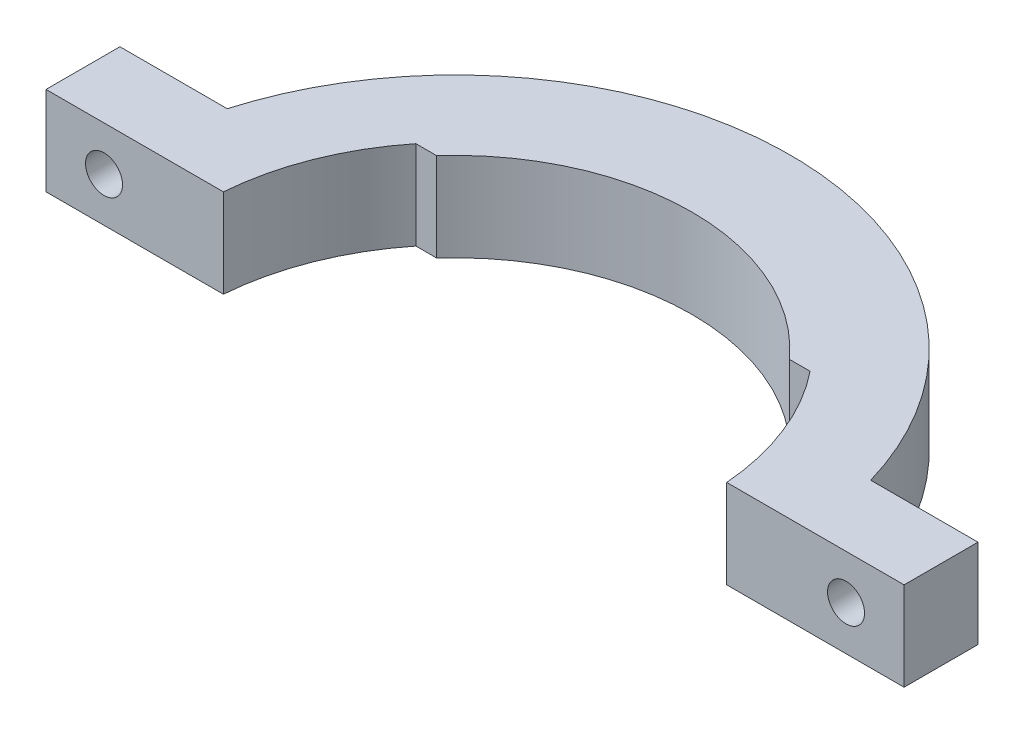
ISO-10303-21;
HEADER;
FILE_DESCRIPTION(('STEP AP214'),'2;1');
FILE_NAME('part.step','',(''),(''),'','','');
FILE_SCHEMA(('AUTOMOTIVE_DESIGN { 1 0 10303 214 1 1 1 1 }'));
ENDSEC;
DATA;
#1=APPLICATION_CONTEXT('core data for automotive mechanical design processes');
#2=APPLICATION_PROTOCOL_DEFINITION('international standard','automotive_design',2000,#1);
#3=PRODUCT_CONTEXT('',#1,'mechanical');
#4=PRODUCT('Part','Part','',(#3));
#5=PRODUCT_RELATED_PRODUCT_CATEGORY('part','',(#4));
#6=PRODUCT_DEFINITION_FORMATION('','',#4);
#7=PRODUCT_DEFINITION_CONTEXT('part definition',#1,'design');
#8=PRODUCT_DEFINITION('design','',#6,#7);
#9=PRODUCT_DEFINITION_SHAPE('','',#8);
#10=(LENGTH_UNIT() NAMED_UNIT(*) SI_UNIT(.MILLI.,.METRE.));
#11=(NAMED_UNIT(*) PLANE_ANGLE_UNIT() SI_UNIT($,.RADIAN.));
#12=(NAMED_UNIT(*) SI_UNIT($,.STERADIAN.) SOLID_ANGLE_UNIT());
#13=UNCERTAINTY_MEASURE_WITH_UNIT(LENGTH_MEASURE(1.E-05),#10,'distance_accuracy_value','');
#14=(GEOMETRIC_REPRESENTATION_CONTEXT(3) GLOBAL_UNCERTAINTY_ASSIGNED_CONTEXT((#13)) GLOBAL_UNIT_ASSIGNED_CONTEXT((#10,
#11,#12)) REPRESENTATION_CONTEXT('',''));
#15=CARTESIAN_POINT('',(0.,0.,0.));
#16=DIRECTION('',(0.,0.,1.));
#17=DIRECTION('',(1.,0.,0.));
#18=AXIS2_PLACEMENT_3D('',#15,#16,#17);
#19=CARTESIAN_POINT('',(37.645,4.5,-2.));
#20=DIRECTION('',(0.,0.,-1.));
#21=DIRECTION('',(-1.,0.,0.));
#22=AXIS2_PLACEMENT_3D('',#19,#20,#21);
#23=CYLINDRICAL_SURFACE('',#22,1.875);
#24=CARTESIAN_POINT('',(37.645,4.5,-2.));
#25=DIRECTION('',(0.,0.,-1.));
#26=DIRECTION('',(-1.,0.,0.));
#27=AXIS2_PLACEMENT_3D('',#24,#25,#26);
#28=CIRCLE('',#27,1.875);
#29=CARTESIAN_POINT('',(35.77,4.5,-2.));
#30=VERTEX_POINT('',#29);
#31=EDGE_CURVE('E427',#30,#30,#28,.T.);
#32=ORIENTED_EDGE('',*,*,#31,.F.);
#33=EDGE_LOOP('',(#32));
#34=FACE_BOUND('',#33,.T.);
#35=CARTESIAN_POINT('',(37.645,4.5,-6.69999999999999));
#36=DIRECTION('',(0.,0.,-1.));
#37=DIRECTION('',(-1.,0.,0.));
#38=AXIS2_PLACEMENT_3D('',#35,#36,#37);
#39=CIRCLE('',#38,1.875);
#40=CARTESIAN_POINT('',(35.77,4.5,-6.69999999999999));
#41=VERTEX_POINT('',#40);
#42=EDGE_CURVE('E441',#41,#41,#39,.T.);
#43=ORIENTED_EDGE('',*,*,#42,.T.);
#44=EDGE_LOOP('',(#43));
#45=FACE_BOUND('',#44,.T.);
#46=ADVANCED_FACE('F33',(#34,#45),#23,.F.);
#47=CARTESIAN_POINT('',(0.,9.,0.));
#48=DIRECTION('',(0.,-1.,0.));
#49=DIRECTION('',(0.,0.,-1.));
#50=AXIS2_PLACEMENT_3D('',#47,#48,#49);
#51=CYLINDRICAL_SURFACE('',#50,25.6124969497314);
#52=CARTESIAN_POINT('',(0.,0.,0.));
#53=DIRECTION('',(0.,-1.,0.));
#54=DIRECTION('',(0.,0.,-1.));
#55=AXIS2_PLACEMENT_3D('',#52,#53,#54);
#56=CIRCLE('',#55,25.6124969497314);
#57=CARTESIAN_POINT('',(-25.5342906696074,0.,-2.));
#58=VERTEX_POINT('',#57);
#59=CARTESIAN_POINT('',(-20.,0.,-16.));
#60=VERTEX_POINT('',#59);
#61=EDGE_CURVE('E154',#58,#60,#56,.T.);
#62=ORIENTED_EDGE('',*,*,#61,.T.);
#63=DIRECTION('',(0.,-1.,0.));
#64=VECTOR('',#63,1.);
#65=CARTESIAN_POINT('',(-20.,9.,-16.));
#66=LINE('',#65,#64);
#67=CARTESIAN_POINT('',(-20.,9.,-16.));
#68=VERTEX_POINT('',#67);
#69=EDGE_CURVE('E11',#68,#60,#66,.T.);
#70=ORIENTED_EDGE('',*,*,#69,.F.);
#71=CARTESIAN_POINT('',(0.,9.,0.));
#72=DIRECTION('',(0.,-1.,0.));
#73=DIRECTION('',(0.,0.,-1.));
#74=AXIS2_PLACEMENT_3D('',#71,#72,#73);
#75=CIRCLE('',#74,25.6124969497314);
#76=CARTESIAN_POINT('',(-25.5342906696074,9.,-2.));
#77=VERTEX_POINT('',#76);
#78=EDGE_CURVE('E177',#77,#68,#75,.T.);
#79=ORIENTED_EDGE('',*,*,#78,.F.);
#80=DIRECTION('',(0.,-1.,0.));
#81=VECTOR('',#80,1.);
#82=CARTESIAN_POINT('',(-25.5342906696074,9.,-2.));
#83=LINE('',#82,#81);
#84=EDGE_CURVE('E150',#77,#58,#83,.T.);
#85=ORIENTED_EDGE('',*,*,#84,.T.);
#86=EDGE_LOOP('',(#62,#70,#79,#85));
#87=FACE_BOUND('',#86,.T.);
#88=ADVANCED_FACE('F35',(#87),#51,.F.);
#89=CARTESIAN_POINT('',(-17.8885438199983,9.,-16.));
#90=DIRECTION('',(0.,0.,-1.));
#91=DIRECTION('',(-1.,0.,0.));
#92=AXIS2_PLACEMENT_3D('',#89,#90,#91);
#93=PLANE('',#92);
#94=DIRECTION('',(1.,0.,0.));
#95=VECTOR('',#94,1.);
#96=CARTESIAN_POINT('',(-17.8885438199983,0.,-16.));
#97=LINE('',#96,#95);
#98=CARTESIAN_POINT('',(-17.8885438199983,0.,-16.));
#99=VERTEX_POINT('',#98);
#100=EDGE_CURVE('E157',#60,#99,#97,.T.);
#101=ORIENTED_EDGE('',*,*,#100,.T.);
#102=DIRECTION('',(0.,-1.,0.));
#103=VECTOR('',#102,1.);
#104=CARTESIAN_POINT('',(-17.8885438199983,9.,-16.));
#105=LINE('',#104,#103);
#106=CARTESIAN_POINT('',(-17.8885438199983,9.,-16.));
#107=VERTEX_POINT('',#106);
#108=EDGE_CURVE('E42',#107,#99,#105,.T.);
#109=ORIENTED_EDGE('',*,*,#108,.F.);
#110=DIRECTION('',(1.,0.,0.));
#111=VECTOR('',#110,1.);
#112=CARTESIAN_POINT('',(-17.8885438199983,9.,-16.));
#113=LINE('',#112,#111);
#114=EDGE_CURVE('E105',#68,#107,#113,.T.);
#115=ORIENTED_EDGE('',*,*,#114,.F.);
#116=ORIENTED_EDGE('',*,*,#69,.T.);
#117=EDGE_LOOP('',(#101,#109,#115,#116));
#118=FACE_BOUND('',#117,.T.);
#119=ADVANCED_FACE('F262',(#118),#93,.F.);
#120=CARTESIAN_POINT('',(0.,9.,0.));
#121=DIRECTION('',(0.,-1.,0.));
#122=DIRECTION('',(0.,0.,-1.));
#123=AXIS2_PLACEMENT_3D('',#120,#121,#122);
#124=CYLINDRICAL_SURFACE('',#123,24.);
#125=CARTESIAN_POINT('',(0.,0.,0.));
#126=DIRECTION('',(0.,-1.,0.));
#127=DIRECTION('',(0.,0.,1.));
#128=AXIS2_PLACEMENT_3D('',#125,#126,#127);
#129=CIRCLE('',#128,24.);
#130=CARTESIAN_POINT('',(17.8885438199983,0.,-16.));
#131=VERTEX_POINT('',#130);
#132=EDGE_CURVE('E160',#99,#131,#129,.T.);
#133=ORIENTED_EDGE('',*,*,#132,.T.);
#134=DIRECTION('',(0.,-1.,0.));
#135=VECTOR('',#134,1.);
#136=CARTESIAN_POINT('',(17.8885438199983,9.,-16.));
#137=LINE('',#136,#135);
#138=CARTESIAN_POINT('',(17.8885438199983,9.,-16.));
#139=VERTEX_POINT('',#138);
#140=EDGE_CURVE('E196',#139,#131,#137,.T.);
#141=ORIENTED_EDGE('',*,*,#140,.F.);
#142=CARTESIAN_POINT('',(0.,9.,0.));
#143=DIRECTION('',(0.,-1.,0.));
#144=DIRECTION('',(0.,0.,1.));
#145=AXIS2_PLACEMENT_3D('',#142,#143,#144);
#146=CIRCLE('',#145,24.);
#147=EDGE_CURVE('E204',#107,#139,#146,.T.);
#148=ORIENTED_EDGE('',*,*,#147,.F.);
#149=ORIENTED_EDGE('',*,*,#108,.T.);
#150=EDGE_LOOP('',(#133,#141,#148,#149));
#151=FACE_BOUND('',#150,.T.);
#152=ADVANCED_FACE('F202',(#151),#124,.F.);
#153=CARTESIAN_POINT('',(17.8885438199983,9.,-16.));
#154=DIRECTION('',(0.,0.,-1.));
#155=DIRECTION('',(-1.,0.,0.));
#156=AXIS2_PLACEMENT_3D('',#153,#154,#155);
#157=PLANE('',#156);
#158=DIRECTION('',(1.,0.,0.));
#159=VECTOR('',#158,1.);
#160=CARTESIAN_POINT('',(17.8885438199983,0.,-16.));
#161=LINE('',#160,#159);
#162=CARTESIAN_POINT('',(20.,0.,-16.));
#163=VERTEX_POINT('',#162);
#164=EDGE_CURVE('E162',#131,#163,#161,.T.);
#165=ORIENTED_EDGE('',*,*,#164,.T.);
#166=DIRECTION('',(0.,-1.,0.));
#167=VECTOR('',#166,1.);
#168=CARTESIAN_POINT('',(20.,9.,-16.));
#169=LINE('',#168,#167);
#170=CARTESIAN_POINT('',(20.,9.,-16.));
#171=VERTEX_POINT('',#170);
#172=EDGE_CURVE('E193',#171,#163,#169,.T.);
#173=ORIENTED_EDGE('',*,*,#172,.F.);
#174=DIRECTION('',(1.,0.,0.));
#175=VECTOR('',#174,1.);
#176=CARTESIAN_POINT('',(17.8885438199983,9.,-16.));
#177=LINE('',#176,#175);
#178=EDGE_CURVE('E222',#139,#171,#177,.T.);
#179=ORIENTED_EDGE('',*,*,#178,.F.);
#180=ORIENTED_EDGE('',*,*,#140,.T.);
#181=EDGE_LOOP('',(#165,#173,#179,#180));
#182=FACE_BOUND('',#181,.T.);
#183=ADVANCED_FACE('F213',(#182),#157,.F.);
#184=CARTESIAN_POINT('',(0.,9.,0.));
#185=DIRECTION('',(0.,-1.,0.));
#186=DIRECTION('',(0.,0.,-1.));
#187=AXIS2_PLACEMENT_3D('',#184,#185,#186);
#188=CYLINDRICAL_SURFACE('',#187,25.6124969497314);
#189=CARTESIAN_POINT('',(0.,0.,0.));
#190=DIRECTION('',(0.,-1.,0.));
#191=DIRECTION('',(0.,0.,1.));
#192=AXIS2_PLACEMENT_3D('',#189,#190,#191);
#193=CIRCLE('',#192,25.6124969497314);
#194=CARTESIAN_POINT('',(25.5342906696074,0.,-2.));
#195=VERTEX_POINT('',#194);
#196=EDGE_CURVE('E164',#163,#195,#193,.T.);
#197=ORIENTED_EDGE('',*,*,#196,.T.);
#198=DIRECTION('',(0.,-1.,0.));
#199=VECTOR('',#198,1.);
#200=CARTESIAN_POINT('',(25.5342906696074,9.,-2.));
#201=LINE('',#200,#199);
#202=CARTESIAN_POINT('',(25.5342906696074,9.,-2.));
#203=VERTEX_POINT('',#202);
#204=EDGE_CURVE('E190',#203,#195,#201,.T.);
#205=ORIENTED_EDGE('',*,*,#204,.F.);
#206=CARTESIAN_POINT('',(0.,9.,0.));
#207=DIRECTION('',(0.,-1.,0.));
#208=DIRECTION('',(0.,0.,1.));
#209=AXIS2_PLACEMENT_3D('',#206,#207,#208);
#210=CIRCLE('',#209,25.6124969497314);
#211=EDGE_CURVE('E219',#171,#203,#210,.T.);
#212=ORIENTED_EDGE('',*,*,#211,.F.);
#213=ORIENTED_EDGE('',*,*,#172,.T.);
#214=EDGE_LOOP('',(#197,#205,#212,#213));
#215=FACE_BOUND('',#214,.T.);
#216=ADVANCED_FACE('F217',(#215),#188,.F.);
#217=CARTESIAN_POINT('',(25.5342906696074,9.,-2.));
#218=DIRECTION('',(0.,0.,-1.));
#219=DIRECTION('',(-1.,0.,0.));
#220=AXIS2_PLACEMENT_3D('',#217,#218,#219);
#221=PLANE('',#220);
#222=ORIENTED_EDGE('',*,*,#31,.T.);
#223=EDGE_LOOP('',(#222));
#224=FACE_BOUND('',#223,.T.);
#225=DIRECTION('',(1.,0.,0.));
#226=VECTOR('',#225,1.);
#227=CARTESIAN_POINT('',(25.5342906696074,0.,-2.));
#228=LINE('',#227,#226);
#229=CARTESIAN_POINT('',(43.5342906696074,0.,-2.));
#230=VERTEX_POINT('',#229);
#231=EDGE_CURVE('E166',#195,#230,#228,.T.);
#232=ORIENTED_EDGE('',*,*,#231,.T.);
#233=DIRECTION('',(0.,-1.,0.));
#234=VECTOR('',#233,1.);
#235=CARTESIAN_POINT('',(43.5342906696074,9.,-2.));
#236=LINE('',#235,#234);
#237=CARTESIAN_POINT('',(43.5342906696074,9.,-2.));
#238=VERTEX_POINT('',#237);
#239=EDGE_CURVE('E187',#238,#230,#236,.T.);
#240=ORIENTED_EDGE('',*,*,#239,.F.);
#241=DIRECTION('',(1.,0.,0.));
#242=VECTOR('',#241,1.);
#243=CARTESIAN_POINT('',(25.5342906696074,9.,-2.));
#244=LINE('',#243,#242);
#245=EDGE_CURVE('E221',#203,#238,#244,.T.);
#246=ORIENTED_EDGE('',*,*,#245,.F.);
#247=ORIENTED_EDGE('',*,*,#204,.T.);
#248=EDGE_LOOP('',(#232,#240,#246,#247));
#249=FACE_BOUND('',#248,.T.);
#250=ADVANCED_FACE('F372',(#224,#249),#221,.F.);
#251=CARTESIAN_POINT('',(43.5342906696074,9.,-2.));
#252=DIRECTION('',(-1.,0.,0.));
#253=DIRECTION('',(0.,0.,1.));
#254=AXIS2_PLACEMENT_3D('',#251,#252,#253);
#255=PLANE('',#254);
#256=DIRECTION('',(0.,0.,-1.));
#257=VECTOR('',#256,1.);
#258=CARTESIAN_POINT('',(43.5342906696074,0.,-2.));
#259=LINE('',#258,#257);
#260=CARTESIAN_POINT('',(43.5342906696074,0.,-9.5));
#261=VERTEX_POINT('',#260);
#262=EDGE_CURVE('E168',#230,#261,#259,.T.);
#263=ORIENTED_EDGE('',*,*,#262,.T.);
#264=DIRECTION('',(0.,-1.,0.));
#265=VECTOR('',#264,1.);
#266=CARTESIAN_POINT('',(43.5342906696074,9.,-9.5));
#267=LINE('',#266,#265);
#268=CARTESIAN_POINT('',(43.5342906696074,9.,-9.5));
#269=VERTEX_POINT('',#268);
#270=EDGE_CURVE('E184',#269,#261,#267,.T.);
#271=ORIENTED_EDGE('',*,*,#270,.F.);
#272=DIRECTION('',(0.,0.,-1.));
#273=VECTOR('',#272,1.);
#274=CARTESIAN_POINT('',(43.5342906696074,9.,-2.));
#275=LINE('',#274,#273);
#276=EDGE_CURVE('E224',#238,#269,#275,.T.);
#277=ORIENTED_EDGE('',*,*,#276,.F.);
#278=ORIENTED_EDGE('',*,*,#239,.T.);
#279=EDGE_LOOP('',(#263,#271,#277,#278));
#280=FACE_BOUND('',#279,.T.);
#281=ADVANCED_FACE('F364',(#280),#255,.F.);
#282=CARTESIAN_POINT('',(43.5342906696074,9.,-9.5));
#283=DIRECTION('',(0.,0.,1.));
#284=DIRECTION('',(1.,0.,0.));
#285=AXIS2_PLACEMENT_3D('',#282,#283,#284);
#286=PLANE('',#285);
#287=CARTESIAN_POINT('',(37.645,4.5,-9.49999999999999));
#288=DIRECTION('',(0.,0.,-1.));
#289=DIRECTION('',(-1.,0.,0.));
#290=AXIS2_PLACEMENT_3D('',#287,#288,#289);
#291=CIRCLE('',#290,3.5);
#292=CARTESIAN_POINT('',(34.145,4.5,-9.49999999999999));
#293=VERTEX_POINT('',#292);
#294=EDGE_CURVE('E435',#293,#293,#291,.T.);
#295=ORIENTED_EDGE('',*,*,#294,.F.);
#296=EDGE_LOOP('',(#295));
#297=FACE_BOUND('',#296,.T.);
#298=DIRECTION('',(-1.,0.,0.));
#299=VECTOR('',#298,1.);
#300=CARTESIAN_POINT('',(43.5342906696074,0.,-9.5));
#301=LINE('',#300,#299);
#302=CARTESIAN_POINT('',(32.6458266858108,0.,-9.49999999999999));
#303=VERTEX_POINT('',#302);
#304=EDGE_CURVE('E170',#261,#303,#301,.T.);
#305=ORIENTED_EDGE('',*,*,#304,.T.);
#306=DIRECTION('',(0.,-1.,0.));
#307=VECTOR('',#306,1.);
#308=CARTESIAN_POINT('',(32.6458266858108,9.,-9.49999999999999));
#309=LINE('',#308,#307);
#310=CARTESIAN_POINT('',(32.6458266858108,9.,-9.49999999999999));
#311=VERTEX_POINT('',#310);
#312=EDGE_CURVE('E181',#311,#303,#309,.T.);
#313=ORIENTED_EDGE('',*,*,#312,.F.);
#314=DIRECTION('',(-1.,0.,0.));
#315=VECTOR('',#314,1.);
#316=CARTESIAN_POINT('',(43.5342906696074,9.,-9.5));
#317=LINE('',#316,#315);
#318=EDGE_CURVE('E230',#269,#311,#317,.T.);
#319=ORIENTED_EDGE('',*,*,#318,.F.);
#320=ORIENTED_EDGE('',*,*,#270,.T.);
#321=EDGE_LOOP('',(#305,#313,#319,#320));
#322=FACE_BOUND('',#321,.T.);
#323=ADVANCED_FACE('F236',(#297,#322),#286,.F.);
#324=CARTESIAN_POINT('',(0.,9.,0.));
#325=DIRECTION('',(0.,-1.,0.));
#326=DIRECTION('',(0.,0.,-1.));
#327=AXIS2_PLACEMENT_3D('',#324,#325,#326);
#328=CYLINDRICAL_SURFACE('',#327,34.);
#329=CARTESIAN_POINT('',(0.,0.,0.));
#330=DIRECTION('',(0.,1.,0.));
#331=DIRECTION('',(0.,0.,1.));
#332=AXIS2_PLACEMENT_3D('',#329,#330,#331);
#333=CIRCLE('',#332,34.);
#334=CARTESIAN_POINT('',(-32.6458266858109,0.,-9.5));
#335=VERTEX_POINT('',#334);
#336=EDGE_CURVE('E172',#303,#335,#333,.T.);
#337=ORIENTED_EDGE('',*,*,#336,.T.);
#338=DIRECTION('',(0.,-1.,0.));
#339=VECTOR('',#338,1.);
#340=CARTESIAN_POINT('',(-32.6458266858109,9.,-9.5));
#341=LINE('',#340,#339);
#342=CARTESIAN_POINT('',(-32.6458266858109,9.,-9.5));
#343=VERTEX_POINT('',#342);
#344=EDGE_CURVE('E145',#343,#335,#341,.T.);
#345=ORIENTED_EDGE('',*,*,#344,.F.);
#346=CARTESIAN_POINT('',(0.,9.,0.));
#347=DIRECTION('',(0.,1.,0.));
#348=DIRECTION('',(0.,0.,1.));
#349=AXIS2_PLACEMENT_3D('',#346,#347,#348);
#350=CIRCLE('',#349,34.);
#351=EDGE_CURVE('E136',#311,#343,#350,.T.);
#352=ORIENTED_EDGE('',*,*,#351,.F.);
#353=ORIENTED_EDGE('',*,*,#312,.T.);
#354=EDGE_LOOP('',(#337,#345,#352,#353));
#355=FACE_BOUND('',#354,.T.);
#356=ADVANCED_FACE('F240',(#355),#328,.T.);
#357=CARTESIAN_POINT('',(-43.5342906696074,9.,-9.5));
#358=DIRECTION('',(0.,0.,1.));
#359=DIRECTION('',(1.,0.,0.));
#360=AXIS2_PLACEMENT_3D('',#357,#358,#359);
#361=PLANE('',#360);
#362=CARTESIAN_POINT('',(-37.645,4.5,-9.49999999999998));
#363=DIRECTION('',(0.,0.,-1.));
#364=DIRECTION('',(1.,0.,0.));
#365=AXIS2_PLACEMENT_3D('',#362,#363,#364);
#366=CIRCLE('',#365,3.5);
#367=CARTESIAN_POINT('',(-34.145,4.5,-9.49999999999998));
#368=VERTEX_POINT('',#367);
#369=EDGE_CURVE('E446',#368,#368,#366,.T.);
#370=ORIENTED_EDGE('',*,*,#369,.F.);
#371=EDGE_LOOP('',(#370));
#372=FACE_BOUND('',#371,.T.);
#373=DIRECTION('',(-1.,0.,0.));
#374=VECTOR('',#373,1.);
#375=CARTESIAN_POINT('',(-43.5342906696074,0.,-9.5));
#376=LINE('',#375,#374);
#377=CARTESIAN_POINT('',(-43.5342906696074,0.,-9.5));
#378=VERTEX_POINT('',#377);
#379=EDGE_CURVE('E144',#335,#378,#376,.T.);
#380=ORIENTED_EDGE('',*,*,#379,.T.);
#381=DIRECTION('',(0.,-1.,0.));
#382=VECTOR('',#381,1.);
#383=CARTESIAN_POINT('',(-43.5342906696074,9.,-9.5));
#384=LINE('',#383,#382);
#385=CARTESIAN_POINT('',(-43.5342906696074,9.,-9.5));
#386=VERTEX_POINT('',#385);
#387=EDGE_CURVE('E141',#386,#378,#384,.T.);
#388=ORIENTED_EDGE('',*,*,#387,.F.);
#389=DIRECTION('',(-1.,0.,0.));
#390=VECTOR('',#389,1.);
#391=CARTESIAN_POINT('',(-43.5342906696074,9.,-9.5));
#392=LINE('',#391,#390);
#393=EDGE_CURVE('E130',#343,#386,#392,.T.);
#394=ORIENTED_EDGE('',*,*,#393,.F.);
#395=ORIENTED_EDGE('',*,*,#344,.T.);
#396=EDGE_LOOP('',(#380,#388,#394,#395));
#397=FACE_BOUND('',#396,.T.);
#398=ADVANCED_FACE('F142',(#372,#397),#361,.F.);
#399=CARTESIAN_POINT('',(-43.5342906696074,9.,-2.));
#400=DIRECTION('',(1.,0.,0.));
#401=DIRECTION('',(0.,0.,-1.));
#402=AXIS2_PLACEMENT_3D('',#399,#400,#401);
#403=PLANE('',#402);
#404=DIRECTION('',(0.,0.,1.));
#405=VECTOR('',#404,1.);
#406=CARTESIAN_POINT('',(-43.5342906696074,0.,-2.));
#407=LINE('',#406,#405);
#408=CARTESIAN_POINT('',(-43.5342906696074,0.,-2.));
#409=VERTEX_POINT('',#408);
#410=EDGE_CURVE('E91',#378,#409,#407,.T.);
#411=ORIENTED_EDGE('',*,*,#410,.T.);
#412=DIRECTION('',(0.,-1.,0.));
#413=VECTOR('',#412,1.);
#414=CARTESIAN_POINT('',(-43.5342906696074,9.,-2.));
#415=LINE('',#414,#413);
#416=CARTESIAN_POINT('',(-43.5342906696074,9.,-2.));
#417=VERTEX_POINT('',#416);
#418=EDGE_CURVE('E146',#417,#409,#415,.T.);
#419=ORIENTED_EDGE('',*,*,#418,.F.);
#420=DIRECTION('',(0.,0.,1.));
#421=VECTOR('',#420,1.);
#422=CARTESIAN_POINT('',(-43.5342906696074,9.,-2.));
#423=LINE('',#422,#421);
#424=EDGE_CURVE('E134',#386,#417,#423,.T.);
#425=ORIENTED_EDGE('',*,*,#424,.F.);
#426=ORIENTED_EDGE('',*,*,#387,.T.);
#427=EDGE_LOOP('',(#411,#419,#425,#426));
#428=FACE_BOUND('',#427,.T.);
#429=ADVANCED_FACE('F148',(#428),#403,.F.);
#430=CARTESIAN_POINT('',(-25.5342906696074,9.,-2.));
#431=DIRECTION('',(0.,0.,-1.));
#432=DIRECTION('',(-1.,0.,0.));
#433=AXIS2_PLACEMENT_3D('',#430,#431,#432);
#434=PLANE('',#433);
#435=CARTESIAN_POINT('',(-37.645,4.5,-1.99999999999999));
#436=DIRECTION('',(0.,0.,-1.));
#437=DIRECTION('',(-1.,0.,0.));
#438=AXIS2_PLACEMENT_3D('',#435,#436,#437);
#439=CIRCLE('',#438,1.875);
#440=CARTESIAN_POINT('',(-39.52,4.5,-1.99999999999999));
#441=VERTEX_POINT('',#440);
#442=EDGE_CURVE('E158',#441,#441,#439,.F.);
#443=ORIENTED_EDGE('',*,*,#442,.F.);
#444=EDGE_LOOP('',(#443));
#445=FACE_BOUND('',#444,.T.);
#446=DIRECTION('',(1.,0.,0.));
#447=VECTOR('',#446,1.);
#448=CARTESIAN_POINT('',(-25.5342906696074,0.,-2.));
#449=LINE('',#448,#447);
#450=EDGE_CURVE('E97',#409,#58,#449,.T.);
#451=ORIENTED_EDGE('',*,*,#450,.T.);
#452=ORIENTED_EDGE('',*,*,#84,.F.);
#453=DIRECTION('',(1.,0.,0.));
#454=VECTOR('',#453,1.);
#455=CARTESIAN_POINT('',(-25.5342906696074,9.,-2.));
#456=LINE('',#455,#454);
#457=EDGE_CURVE('E50',#417,#77,#456,.T.);
#458=ORIENTED_EDGE('',*,*,#457,.F.);
#459=ORIENTED_EDGE('',*,*,#418,.T.);
#460=EDGE_LOOP('',(#451,#452,#458,#459));
#461=FACE_BOUND('',#460,.T.);
#462=ADVANCED_FACE('F244',(#445,#461),#434,.F.);
#463=CARTESIAN_POINT('',(0.,9.,0.));
#464=DIRECTION('',(0.,-1.,0.));
#465=DIRECTION('',(0.,0.,-1.));
#466=AXIS2_PLACEMENT_3D('',#463,#464,#465);
#467=PLANE('',#466);
#468=ORIENTED_EDGE('',*,*,#78,.T.);
#469=ORIENTED_EDGE('',*,*,#114,.T.);
#470=ORIENTED_EDGE('',*,*,#147,.T.);
#471=ORIENTED_EDGE('',*,*,#178,.T.);
#472=ORIENTED_EDGE('',*,*,#211,.T.);
#473=ORIENTED_EDGE('',*,*,#245,.T.);
#474=ORIENTED_EDGE('',*,*,#276,.T.);
#475=ORIENTED_EDGE('',*,*,#318,.T.);
#476=ORIENTED_EDGE('',*,*,#351,.T.);
#477=ORIENTED_EDGE('',*,*,#393,.T.);
#478=ORIENTED_EDGE('',*,*,#424,.T.);
#479=ORIENTED_EDGE('',*,*,#457,.T.);
#480=EDGE_LOOP('',(#468,#469,#470,#471,#472,#473,#474,#475,#476,#477,#478,#479));
#481=FACE_BOUND('',#480,.T.);
#482=ADVANCED_FACE('F132',(#481),#467,.F.);
#483=CARTESIAN_POINT('',(0.,0.,0.));
#484=DIRECTION('',(0.,-1.,0.));
#485=DIRECTION('',(0.,0.,-1.));
#486=AXIS2_PLACEMENT_3D('',#483,#484,#485);
#487=PLANE('',#486);
#488=ORIENTED_EDGE('',*,*,#61,.F.);
#489=ORIENTED_EDGE('',*,*,#450,.F.);
#490=ORIENTED_EDGE('',*,*,#410,.F.);
#491=ORIENTED_EDGE('',*,*,#379,.F.);
#492=ORIENTED_EDGE('',*,*,#336,.F.);
#493=ORIENTED_EDGE('',*,*,#304,.F.);
#494=ORIENTED_EDGE('',*,*,#262,.F.);
#495=ORIENTED_EDGE('',*,*,#231,.F.);
#496=ORIENTED_EDGE('',*,*,#196,.F.);
#497=ORIENTED_EDGE('',*,*,#164,.F.);
#498=ORIENTED_EDGE('',*,*,#132,.F.);
#499=ORIENTED_EDGE('',*,*,#100,.F.);
#500=EDGE_LOOP('',(#488,#489,#490,#491,#492,#493,#494,#495,#496,#497,#498,#499));
#501=FACE_BOUND('',#500,.T.);
#502=ADVANCED_FACE('F208',(#501),#487,.T.);
#503=CARTESIAN_POINT('',(-37.645,4.5,-1.99999999999999));
#504=DIRECTION('',(0.,0.,-1.));
#505=DIRECTION('',(-1.,0.,0.));
#506=AXIS2_PLACEMENT_3D('',#503,#504,#505);
#507=CYLINDRICAL_SURFACE('',#506,1.875);
#508=CARTESIAN_POINT('',(-37.645,4.5,-6.69999999999998));
#509=DIRECTION('',(0.,0.,-1.));
#510=DIRECTION('',(1.,0.,0.));
#511=AXIS2_PLACEMENT_3D('',#508,#509,#510);
#512=CIRCLE('',#511,1.875);
#513=CARTESIAN_POINT('',(-35.77,4.5,-6.69999999999998));
#514=VERTEX_POINT('',#513);
#515=EDGE_CURVE('E449',#514,#514,#512,.T.);
#516=ORIENTED_EDGE('',*,*,#515,.T.);
#517=EDGE_LOOP('',(#516));
#518=FACE_BOUND('',#517,.T.);
#519=ORIENTED_EDGE('',*,*,#442,.T.);
#520=EDGE_LOOP('',(#519));
#521=FACE_BOUND('',#520,.T.);
#522=ADVANCED_FACE('F269',(#518,#521),#507,.F.);
#523=CARTESIAN_POINT('',(37.645,4.5,-6.69999999999999));
#524=DIRECTION('',(0.,0.,-1.));
#525=DIRECTION('',(-1.,0.,0.));
#526=AXIS2_PLACEMENT_3D('',#523,#524,#525);
#527=CYLINDRICAL_SURFACE('',#526,3.5);
#528=CARTESIAN_POINT('',(37.645,4.5,-6.69999999999999));
#529=DIRECTION('',(0.,0.,-1.));
#530=DIRECTION('',(-1.,0.,0.));
#531=AXIS2_PLACEMENT_3D('',#528,#529,#530);
#532=CIRCLE('',#531,3.5);
#533=CARTESIAN_POINT('',(34.145,4.5,-6.69999999999999));
#534=VERTEX_POINT('',#533);
#535=EDGE_CURVE('E430',#534,#534,#532,.T.);
#536=ORIENTED_EDGE('',*,*,#535,.F.);
#537=EDGE_LOOP('',(#536));
#538=FACE_BOUND('',#537,.T.);
#539=ORIENTED_EDGE('',*,*,#294,.T.);
#540=EDGE_LOOP('',(#539));
#541=FACE_BOUND('',#540,.T.);
#542=ADVANCED_FACE('F267',(#538,#541),#527,.F.);
#543=CARTESIAN_POINT('',(37.645,4.5,-6.69999999999999));
#544=DIRECTION('',(0.,0.,-1.));
#545=DIRECTION('',(-1.,0.,0.));
#546=AXIS2_PLACEMENT_3D('',#543,#544,#545);
#547=PLANE('',#546);
#548=ORIENTED_EDGE('',*,*,#42,.F.);
#549=EDGE_LOOP('',(#548));
#550=FACE_BOUND('',#549,.T.);
#551=ORIENTED_EDGE('',*,*,#535,.T.);
#552=EDGE_LOOP('',(#551));
#553=FACE_BOUND('',#552,.T.);
#554=ADVANCED_FACE('F289',(#550,#553),#547,.T.);
#555=CARTESIAN_POINT('',(-37.645,4.5,-6.69999999999998));
#556=DIRECTION('',(0.,0.,-1.));
#557=DIRECTION('',(-1.,0.,0.));
#558=AXIS2_PLACEMENT_3D('',#555,#556,#557);
#559=CYLINDRICAL_SURFACE('',#558,3.5);
#560=CARTESIAN_POINT('',(-37.645,4.5,-6.69999999999998));
#561=DIRECTION('',(0.,0.,-1.));
#562=DIRECTION('',(1.,0.,0.));
#563=AXIS2_PLACEMENT_3D('',#560,#561,#562);
#564=CIRCLE('',#563,3.5);
#565=CARTESIAN_POINT('',(-34.145,4.5,-6.69999999999998));
#566=VERTEX_POINT('',#565);
#567=EDGE_CURVE('E445',#566,#566,#564,.T.);
#568=ORIENTED_EDGE('',*,*,#567,.F.);
#569=EDGE_LOOP('',(#568));
#570=FACE_BOUND('',#569,.T.);
#571=ORIENTED_EDGE('',*,*,#369,.T.);
#572=EDGE_LOOP('',(#571));
#573=FACE_BOUND('',#572,.T.);
#574=ADVANCED_FACE('F296',(#570,#573),#559,.F.);
#575=CARTESIAN_POINT('',(-37.645,4.5,-6.69999999999998));
#576=DIRECTION('',(0.,0.,1.));
#577=DIRECTION('',(1.,0.,0.));
#578=AXIS2_PLACEMENT_3D('',#575,#576,#577);
#579=PLANE('',#578);
#580=ORIENTED_EDGE('',*,*,#515,.F.);
#581=EDGE_LOOP('',(#580));
#582=FACE_BOUND('',#581,.T.);
#583=ORIENTED_EDGE('',*,*,#567,.T.);
#584=EDGE_LOOP('',(#583));
#585=FACE_BOUND('',#584,.T.);
#586=ADVANCED_FACE('F303',(#582,#585),#579,.F.);
#587=CLOSED_SHELL('',(#46,#88,#119,#152,#183,#216,#250,#281,#323,#356,#398,#429,#462,#482,#502,
#522,#542,#554,#574,#586));
#588=MANIFOLD_SOLID_BREP('B2',#587);
#589=ADVANCED_BREP_SHAPE_REPRESENTATION('',(#18,#588),#14);
#590=SHAPE_DEFINITION_REPRESENTATION(#9,#589);
ENDSEC;
END-ISO-10303-21;
